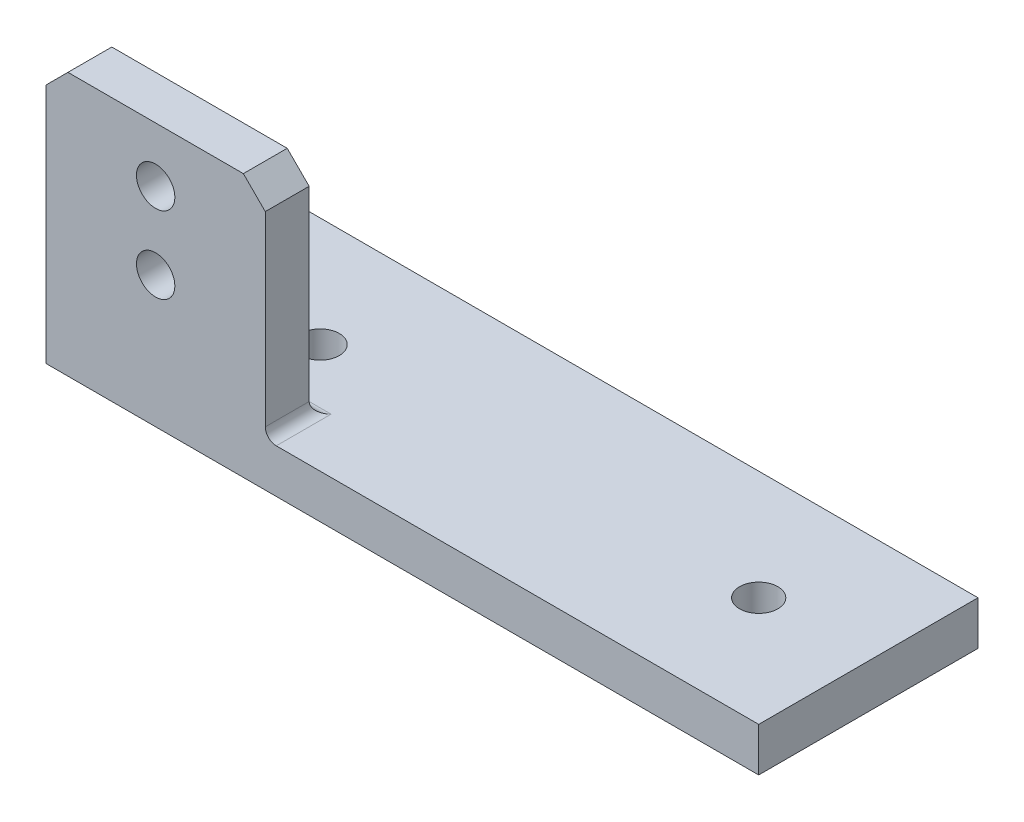
ISO-10303-21;
HEADER;
FILE_DESCRIPTION(('STEP AP214'),'2;1');
FILE_NAME('part.step','',(''),(''),'','','');
FILE_SCHEMA(('AUTOMOTIVE_DESIGN { 1 0 10303 214 1 1 1 1 }'));
ENDSEC;
DATA;
#1=APPLICATION_CONTEXT('core data for automotive mechanical design processes');
#2=APPLICATION_PROTOCOL_DEFINITION('international standard','automotive_design',2000,#1);
#3=PRODUCT_CONTEXT('',#1,'mechanical');
#4=PRODUCT('Part','Part','',(#3));
#5=PRODUCT_RELATED_PRODUCT_CATEGORY('part','',(#4));
#6=PRODUCT_DEFINITION_FORMATION('','',#4);
#7=PRODUCT_DEFINITION_CONTEXT('part definition',#1,'design');
#8=PRODUCT_DEFINITION('design','',#6,#7);
#9=PRODUCT_DEFINITION_SHAPE('','',#8);
#10=(LENGTH_UNIT() NAMED_UNIT(*) SI_UNIT(.MILLI.,.METRE.));
#11=(NAMED_UNIT(*) PLANE_ANGLE_UNIT() SI_UNIT($,.RADIAN.));
#12=(NAMED_UNIT(*) SI_UNIT($,.STERADIAN.) SOLID_ANGLE_UNIT());
#13=UNCERTAINTY_MEASURE_WITH_UNIT(LENGTH_MEASURE(1.E-05),#10,'distance_accuracy_value','');
#14=(GEOMETRIC_REPRESENTATION_CONTEXT(3) GLOBAL_UNCERTAINTY_ASSIGNED_CONTEXT((#13)) GLOBAL_UNIT_ASSIGNED_CONTEXT((#10,
#11,#12)) REPRESENTATION_CONTEXT('',''));
#15=CARTESIAN_POINT('',(0.,0.,0.));
#16=DIRECTION('',(0.,0.,1.));
#17=DIRECTION('',(1.,0.,0.));
#18=AXIS2_PLACEMENT_3D('',#15,#16,#17);
#19=CARTESIAN_POINT('',(65.,4.,20.));
#20=DIRECTION('',(0.,-1.,0.));
#21=DIRECTION('',(0.,0.,-1.));
#22=AXIS2_PLACEMENT_3D('',#19,#20,#21);
#23=PLANE('',#22);
#24=CARTESIAN_POINT('',(55.,4.,10.));
#25=DIRECTION('',(0.,1.,0.));
#26=DIRECTION('',(0.,0.,1.));
#27=AXIS2_PLACEMENT_3D('',#24,#25,#26);
#28=CIRCLE('',#27,1.75);
#29=CARTESIAN_POINT('',(55.,4.,11.75));
#30=VERTEX_POINT('',#29);
#31=EDGE_CURVE('E422',#30,#30,#28,.T.);
#32=ORIENTED_EDGE('',*,*,#31,.F.);
#33=EDGE_LOOP('',(#32));
#34=FACE_BOUND('',#33,.T.);
#35=CARTESIAN_POINT('',(15.,4.,10.));
#36=DIRECTION('',(0.,1.,0.));
#37=DIRECTION('',(0.,0.,1.));
#38=AXIS2_PLACEMENT_3D('',#35,#36,#37);
#39=CIRCLE('',#38,1.75);
#40=CARTESIAN_POINT('',(15.,4.,11.75));
#41=VERTEX_POINT('',#40);
#42=EDGE_CURVE('E433',#41,#41,#39,.T.);
#43=ORIENTED_EDGE('',*,*,#42,.F.);
#44=EDGE_LOOP('',(#43));
#45=FACE_BOUND('',#44,.T.);
#46=DIRECTION('',(-1.,0.,0.));
#47=VECTOR('',#46,1.);
#48=CARTESIAN_POINT('',(65.,4.,0.));
#49=LINE('',#48,#47);
#50=CARTESIAN_POINT('',(65.,4.,0.));
#51=VERTEX_POINT('',#50);
#52=CARTESIAN_POINT('',(2.00000000000001,4.,0.));
#53=VERTEX_POINT('',#52);
#54=EDGE_CURVE('E127',#51,#53,#49,.T.);
#55=ORIENTED_EDGE('',*,*,#54,.T.);
#56=DIRECTION('',(0.707106781186549,0.,-0.707106781186546));
#57=VECTOR('',#56,1.);
#58=CARTESIAN_POINT('',(0.,4.,1.99999999999999));
#59=LINE('',#58,#57);
#60=CARTESIAN_POINT('',(0.,4.,1.99999999999999));
#61=VERTEX_POINT('',#60);
#62=EDGE_CURVE('E11',#53,#61,#59,.F.);
#63=ORIENTED_EDGE('',*,*,#62,.T.);
#64=DIRECTION('',(0.,0.,-1.));
#65=VECTOR('',#64,1.);
#66=CARTESIAN_POINT('',(0.,4.,20.));
#67=LINE('',#66,#65);
#68=CARTESIAN_POINT('',(0.,4.,15.));
#69=VERTEX_POINT('',#68);
#70=EDGE_CURVE('E154',#69,#61,#67,.T.);
#71=ORIENTED_EDGE('',*,*,#70,.F.);
#72=DIRECTION('',(-1.,0.,0.));
#73=VECTOR('',#72,1.);
#74=CARTESIAN_POINT('',(20.,4.,15.));
#75=LINE('',#74,#73);
#76=CARTESIAN_POINT('',(21.,4.,15.));
#77=VERTEX_POINT('',#76);
#78=EDGE_CURVE('E144',#69,#77,#75,.F.);
#79=ORIENTED_EDGE('',*,*,#78,.T.);
#80=DIRECTION('',(0.,0.,-1.));
#81=VECTOR('',#80,1.);
#82=CARTESIAN_POINT('',(21.,4.,20.));
#83=LINE('',#82,#81);
#84=CARTESIAN_POINT('',(21.,4.,20.));
#85=VERTEX_POINT('',#84);
#86=EDGE_CURVE('E175',#77,#85,#83,.F.);
#87=ORIENTED_EDGE('',*,*,#86,.T.);
#88=DIRECTION('',(-1.,0.,0.));
#89=VECTOR('',#88,1.);
#90=CARTESIAN_POINT('',(65.,4.,20.));
#91=LINE('',#90,#89);
#92=CARTESIAN_POINT('',(65.,4.,20.));
#93=VERTEX_POINT('',#92);
#94=EDGE_CURVE('E150',#93,#85,#91,.T.);
#95=ORIENTED_EDGE('',*,*,#94,.F.);
#96=DIRECTION('',(0.,0.,-1.));
#97=VECTOR('',#96,1.);
#98=CARTESIAN_POINT('',(65.,4.,20.));
#99=LINE('',#98,#97);
#100=EDGE_CURVE('E146',#93,#51,#99,.T.);
#101=ORIENTED_EDGE('',*,*,#100,.T.);
#102=EDGE_LOOP('',(#55,#63,#71,#79,#87,#95,#101));
#103=FACE_BOUND('',#102,.T.);
#104=ADVANCED_FACE('F33',(#34,#45,#103),#23,.F.);
#105=CARTESIAN_POINT('',(0.,4.,20.));
#106=DIRECTION('',(1.,0.,0.));
#107=DIRECTION('',(0.,1.,0.));
#108=AXIS2_PLACEMENT_3D('',#105,#106,#107);
#109=PLANE('',#108);
#110=ORIENTED_EDGE('',*,*,#70,.T.);
#111=DIRECTION('',(0.,-1.,0.));
#112=VECTOR('',#111,1.);
#113=CARTESIAN_POINT('',(0.,4.,1.99999999999999));
#114=LINE('',#113,#112);
#115=CARTESIAN_POINT('',(0.,0.,1.99999999999999));
#116=VERTEX_POINT('',#115);
#117=EDGE_CURVE('E140',#61,#116,#114,.T.);
#118=ORIENTED_EDGE('',*,*,#117,.T.);
#119=DIRECTION('',(0.,0.,-1.));
#120=VECTOR('',#119,1.);
#121=CARTESIAN_POINT('',(0.,0.,20.));
#122=LINE('',#121,#120);
#123=CARTESIAN_POINT('',(0.,0.,20.));
#124=VERTEX_POINT('',#123);
#125=EDGE_CURVE('E130',#124,#116,#122,.T.);
#126=ORIENTED_EDGE('',*,*,#125,.F.);
#127=DIRECTION('',(0.,-1.,0.));
#128=VECTOR('',#127,1.);
#129=CARTESIAN_POINT('',(0.,4.,20.));
#130=LINE('',#129,#128);
#131=CARTESIAN_POINT('',(0.,22.,20.));
#132=VERTEX_POINT('',#131);
#133=EDGE_CURVE('E117',#132,#124,#130,.T.);
#134=ORIENTED_EDGE('',*,*,#133,.F.);
#135=DIRECTION('',(0.,0.,-1.));
#136=VECTOR('',#135,1.);
#137=CARTESIAN_POINT('',(0.,22.,20.));
#138=LINE('',#137,#136);
#139=CARTESIAN_POINT('',(0.,22.,16.));
#140=VERTEX_POINT('',#139);
#141=EDGE_CURVE('E194',#132,#140,#138,.T.);
#142=ORIENTED_EDGE('',*,*,#141,.T.);
#143=DIRECTION('',(0.,-1.,0.));
#144=VECTOR('',#143,1.);
#145=CARTESIAN_POINT('',(0.,24.,16.));
#146=LINE('',#145,#144);
#147=CARTESIAN_POINT('',(0.,5.,16.));
#148=VERTEX_POINT('',#147);
#149=EDGE_CURVE('E195',#140,#148,#146,.T.);
#150=ORIENTED_EDGE('',*,*,#149,.T.);
#151=CARTESIAN_POINT('',(0.,5.,15.));
#152=DIRECTION('',(1.,0.,0.));
#153=DIRECTION('',(0.,1.,0.));
#154=AXIS2_PLACEMENT_3D('',#151,#152,#153);
#155=CIRCLE('',#154,1.);
#156=EDGE_CURVE('E170',#148,#69,#155,.T.);
#157=ORIENTED_EDGE('',*,*,#156,.T.);
#158=EDGE_LOOP('',(#110,#118,#126,#134,#142,#150,#157));
#159=FACE_BOUND('',#158,.T.);
#160=ADVANCED_FACE('F138',(#159),#109,.F.);
#161=CARTESIAN_POINT('',(0.,0.,20.));
#162=DIRECTION('',(0.,1.,0.));
#163=DIRECTION('',(0.,0.,1.));
#164=AXIS2_PLACEMENT_3D('',#161,#162,#163);
#165=PLANE('',#164);
#166=CARTESIAN_POINT('',(55.,0.,10.));
#167=DIRECTION('',(0.,1.,0.));
#168=DIRECTION('',(0.,0.,1.));
#169=AXIS2_PLACEMENT_3D('',#166,#167,#168);
#170=CIRCLE('',#169,1.75);
#171=CARTESIAN_POINT('',(55.,0.,11.75));
#172=VERTEX_POINT('',#171);
#173=EDGE_CURVE('E430',#172,#172,#170,.F.);
#174=ORIENTED_EDGE('',*,*,#173,.F.);
#175=EDGE_LOOP('',(#174));
#176=FACE_BOUND('',#175,.T.);
#177=CARTESIAN_POINT('',(15.,0.,10.));
#178=DIRECTION('',(0.,1.,0.));
#179=DIRECTION('',(0.,0.,1.));
#180=AXIS2_PLACEMENT_3D('',#177,#178,#179);
#181=CIRCLE('',#180,1.75);
#182=CARTESIAN_POINT('',(15.,0.,11.75));
#183=VERTEX_POINT('',#182);
#184=EDGE_CURVE('E230',#183,#183,#181,.F.);
#185=ORIENTED_EDGE('',*,*,#184,.F.);
#186=EDGE_LOOP('',(#185));
#187=FACE_BOUND('',#186,.T.);
#188=ORIENTED_EDGE('',*,*,#125,.T.);
#189=DIRECTION('',(-0.707106781186549,0.,0.707106781186546));
#190=VECTOR('',#189,1.);
#191=CARTESIAN_POINT('',(0.,0.,1.99999999999999));
#192=LINE('',#191,#190);
#193=CARTESIAN_POINT('',(1.99999999999999,0.,0.));
#194=VERTEX_POINT('',#193);
#195=EDGE_CURVE('E55',#116,#194,#192,.F.);
#196=ORIENTED_EDGE('',*,*,#195,.T.);
#197=DIRECTION('',(1.,0.,0.));
#198=VECTOR('',#197,1.);
#199=CARTESIAN_POINT('',(0.,0.,0.));
#200=LINE('',#199,#198);
#201=CARTESIAN_POINT('',(65.,0.,0.));
#202=VERTEX_POINT('',#201);
#203=EDGE_CURVE('E160',#194,#202,#200,.T.);
#204=ORIENTED_EDGE('',*,*,#203,.T.);
#205=DIRECTION('',(0.,0.,-1.));
#206=VECTOR('',#205,1.);
#207=CARTESIAN_POINT('',(65.,0.,20.));
#208=LINE('',#207,#206);
#209=CARTESIAN_POINT('',(65.,0.,20.));
#210=VERTEX_POINT('',#209);
#211=EDGE_CURVE('E132',#210,#202,#208,.T.);
#212=ORIENTED_EDGE('',*,*,#211,.F.);
#213=DIRECTION('',(1.,0.,0.));
#214=VECTOR('',#213,1.);
#215=CARTESIAN_POINT('',(0.,0.,20.));
#216=LINE('',#215,#214);
#217=EDGE_CURVE('E121',#124,#210,#216,.T.);
#218=ORIENTED_EDGE('',*,*,#217,.F.);
#219=EDGE_LOOP('',(#188,#196,#204,#212,#218));
#220=FACE_BOUND('',#219,.T.);
#221=ADVANCED_FACE('F129',(#176,#187,#220),#165,.F.);
#222=CARTESIAN_POINT('',(65.,0.,20.));
#223=DIRECTION('',(-1.,0.,0.));
#224=DIRECTION('',(0.,0.,1.));
#225=AXIS2_PLACEMENT_3D('',#222,#223,#224);
#226=PLANE('',#225);
#227=DIRECTION('',(0.,1.,0.));
#228=VECTOR('',#227,1.);
#229=CARTESIAN_POINT('',(65.,0.,0.));
#230=LINE('',#229,#228);
#231=EDGE_CURVE('E162',#202,#51,#230,.T.);
#232=ORIENTED_EDGE('',*,*,#231,.T.);
#233=ORIENTED_EDGE('',*,*,#100,.F.);
#234=DIRECTION('',(0.,1.,0.));
#235=VECTOR('',#234,1.);
#236=CARTESIAN_POINT('',(65.,0.,20.));
#237=LINE('',#236,#235);
#238=EDGE_CURVE('E134',#210,#93,#237,.T.);
#239=ORIENTED_EDGE('',*,*,#238,.F.);
#240=ORIENTED_EDGE('',*,*,#211,.T.);
#241=EDGE_LOOP('',(#232,#233,#239,#240));
#242=FACE_BOUND('',#241,.T.);
#243=ADVANCED_FACE('F266',(#242),#226,.F.);
#244=CARTESIAN_POINT('',(0.,0.,20.));
#245=DIRECTION('',(0.,0.,1.));
#246=DIRECTION('',(1.,0.,0.));
#247=AXIS2_PLACEMENT_3D('',#244,#245,#246);
#248=PLANE('',#247);
#249=CARTESIAN_POINT('',(10.,12.,20.));
#250=DIRECTION('',(0.,0.,1.));
#251=DIRECTION('',(1.,0.,0.));
#252=AXIS2_PLACEMENT_3D('',#249,#250,#251);
#253=CIRCLE('',#252,1.75);
#254=CARTESIAN_POINT('',(11.75,12.,20.));
#255=VERTEX_POINT('',#254);
#256=EDGE_CURVE('E414',#255,#255,#253,.F.);
#257=ORIENTED_EDGE('',*,*,#256,.T.);
#258=EDGE_LOOP('',(#257));
#259=FACE_BOUND('',#258,.T.);
#260=CARTESIAN_POINT('',(10.,19.,20.));
#261=DIRECTION('',(0.,0.,1.));
#262=DIRECTION('',(1.,0.,0.));
#263=AXIS2_PLACEMENT_3D('',#260,#261,#262);
#264=CIRCLE('',#263,1.75);
#265=CARTESIAN_POINT('',(11.75,19.,20.));
#266=VERTEX_POINT('',#265);
#267=EDGE_CURVE('E417',#266,#266,#264,.F.);
#268=ORIENTED_EDGE('',*,*,#267,.T.);
#269=EDGE_LOOP('',(#268));
#270=FACE_BOUND('',#269,.T.);
#271=DIRECTION('',(1.,0.,0.));
#272=VECTOR('',#271,1.);
#273=CARTESIAN_POINT('',(0.,24.,20.));
#274=LINE('',#273,#272);
#275=CARTESIAN_POINT('',(1.99999999999999,24.,20.));
#276=VERTEX_POINT('',#275);
#277=CARTESIAN_POINT('',(18.,24.,20.));
#278=VERTEX_POINT('',#277);
#279=EDGE_CURVE('E224',#276,#278,#274,.T.);
#280=ORIENTED_EDGE('',*,*,#279,.F.);
#281=DIRECTION('',(0.707106781186545,0.70710678118655,0.));
#282=VECTOR('',#281,1.);
#283=CARTESIAN_POINT('',(-11.,10.9999999999999,20.));
#284=LINE('',#283,#282);
#285=EDGE_CURVE('E123',#276,#132,#284,.F.);
#286=ORIENTED_EDGE('',*,*,#285,.T.);
#287=ORIENTED_EDGE('',*,*,#133,.T.);
#288=ORIENTED_EDGE('',*,*,#217,.T.);
#289=ORIENTED_EDGE('',*,*,#238,.T.);
#290=ORIENTED_EDGE('',*,*,#94,.T.);
#291=CARTESIAN_POINT('',(21.,5.,20.));
#292=DIRECTION('',(0.,0.,1.));
#293=DIRECTION('',(1.,0.,0.));
#294=AXIS2_PLACEMENT_3D('',#291,#292,#293);
#295=CIRCLE('',#294,1.);
#296=CARTESIAN_POINT('',(20.,5.,20.));
#297=VERTEX_POINT('',#296);
#298=EDGE_CURVE('E180',#85,#297,#295,.F.);
#299=ORIENTED_EDGE('',*,*,#298,.T.);
#300=DIRECTION('',(0.,-1.,0.));
#301=VECTOR('',#300,1.);
#302=CARTESIAN_POINT('',(20.,24.,20.));
#303=LINE('',#302,#301);
#304=CARTESIAN_POINT('',(20.,22.,20.));
#305=VERTEX_POINT('',#304);
#306=EDGE_CURVE('E163',#305,#297,#303,.T.);
#307=ORIENTED_EDGE('',*,*,#306,.F.);
#308=DIRECTION('',(0.707106781186546,-0.707106781186549,0.));
#309=VECTOR('',#308,1.);
#310=CARTESIAN_POINT('',(21.,21.,20.));
#311=LINE('',#310,#309);
#312=EDGE_CURVE('E189',#305,#278,#311,.F.);
#313=ORIENTED_EDGE('',*,*,#312,.T.);
#314=EDGE_LOOP('',(#280,#286,#287,#288,#289,#290,#299,#307,#313));
#315=FACE_BOUND('',#314,.T.);
#316=ADVANCED_FACE('F120',(#259,#270,#315),#248,.T.);
#317=CARTESIAN_POINT('',(0.,0.,0.));
#318=DIRECTION('',(0.,0.,1.));
#319=DIRECTION('',(1.,0.,0.));
#320=AXIS2_PLACEMENT_3D('',#317,#318,#319);
#321=PLANE('',#320);
#322=ORIENTED_EDGE('',*,*,#203,.F.);
#323=DIRECTION('',(0.,1.,0.));
#324=VECTOR('',#323,1.);
#325=CARTESIAN_POINT('',(1.99999999999999,0.,0.));
#326=LINE('',#325,#324);
#327=EDGE_CURVE('E41',#194,#53,#326,.T.);
#328=ORIENTED_EDGE('',*,*,#327,.T.);
#329=ORIENTED_EDGE('',*,*,#54,.F.);
#330=ORIENTED_EDGE('',*,*,#231,.F.);
#331=EDGE_LOOP('',(#322,#328,#329,#330));
#332=FACE_BOUND('',#331,.T.);
#333=ADVANCED_FACE('F264',(#332),#321,.F.);
#334=CARTESIAN_POINT('',(20.,24.,20.));
#335=DIRECTION('',(-1.,0.,0.));
#336=DIRECTION('',(0.,0.,1.));
#337=AXIS2_PLACEMENT_3D('',#334,#335,#336);
#338=PLANE('',#337);
#339=DIRECTION('',(0.,-1.,0.));
#340=VECTOR('',#339,1.);
#341=CARTESIAN_POINT('',(20.,24.,16.));
#342=LINE('',#341,#340);
#343=CARTESIAN_POINT('',(20.,22.,16.));
#344=VERTEX_POINT('',#343);
#345=CARTESIAN_POINT('',(20.,5.,16.));
#346=VERTEX_POINT('',#345);
#347=EDGE_CURVE('E191',#344,#346,#342,.T.);
#348=ORIENTED_EDGE('',*,*,#347,.F.);
#349=DIRECTION('',(0.,0.,1.));
#350=VECTOR('',#349,1.);
#351=CARTESIAN_POINT('',(20.,22.,20.));
#352=LINE('',#351,#350);
#353=EDGE_CURVE('E204',#344,#305,#352,.T.);
#354=ORIENTED_EDGE('',*,*,#353,.T.);
#355=ORIENTED_EDGE('',*,*,#306,.T.);
#356=DIRECTION('',(0.,0.,-1.));
#357=VECTOR('',#356,1.);
#358=CARTESIAN_POINT('',(20.,5.,15.));
#359=LINE('',#358,#357);
#360=EDGE_CURVE('E172',#297,#346,#359,.T.);
#361=ORIENTED_EDGE('',*,*,#360,.T.);
#362=EDGE_LOOP('',(#348,#354,#355,#361));
#363=FACE_BOUND('',#362,.T.);
#364=ADVANCED_FACE('F211',(#363),#338,.F.);
#365=CARTESIAN_POINT('',(0.,24.,16.));
#366=DIRECTION('',(0.,0.,1.));
#367=DIRECTION('',(1.,0.,0.));
#368=AXIS2_PLACEMENT_3D('',#365,#366,#367);
#369=PLANE('',#368);
#370=CARTESIAN_POINT('',(10.,12.,16.));
#371=DIRECTION('',(0.,0.,-1.));
#372=DIRECTION('',(-1.,0.,0.));
#373=AXIS2_PLACEMENT_3D('',#370,#371,#372);
#374=CIRCLE('',#373,1.75);
#375=CARTESIAN_POINT('',(8.25,12.,16.));
#376=VERTEX_POINT('',#375);
#377=EDGE_CURVE('E419',#376,#376,#374,.T.);
#378=ORIENTED_EDGE('',*,*,#377,.F.);
#379=EDGE_LOOP('',(#378));
#380=FACE_BOUND('',#379,.T.);
#381=CARTESIAN_POINT('',(10.,19.,16.));
#382=DIRECTION('',(0.,0.,-1.));
#383=DIRECTION('',(-1.,0.,0.));
#384=AXIS2_PLACEMENT_3D('',#381,#382,#383);
#385=CIRCLE('',#384,1.75);
#386=CARTESIAN_POINT('',(8.25,19.,16.));
#387=VERTEX_POINT('',#386);
#388=EDGE_CURVE('E418',#387,#387,#385,.T.);
#389=ORIENTED_EDGE('',*,*,#388,.F.);
#390=EDGE_LOOP('',(#389));
#391=FACE_BOUND('',#390,.T.);
#392=ORIENTED_EDGE('',*,*,#149,.F.);
#393=DIRECTION('',(-0.707106781186545,-0.70710678118655,0.));
#394=VECTOR('',#393,1.);
#395=CARTESIAN_POINT('',(1.99999999999999,24.,16.));
#396=LINE('',#395,#394);
#397=CARTESIAN_POINT('',(1.99999999999998,24.,16.));
#398=VERTEX_POINT('',#397);
#399=EDGE_CURVE('E202',#140,#398,#396,.F.);
#400=ORIENTED_EDGE('',*,*,#399,.T.);
#401=DIRECTION('',(-1.,0.,0.));
#402=VECTOR('',#401,1.);
#403=CARTESIAN_POINT('',(0.,24.,16.));
#404=LINE('',#403,#402);
#405=CARTESIAN_POINT('',(18.,24.,16.));
#406=VERTEX_POINT('',#405);
#407=EDGE_CURVE('E197',#406,#398,#404,.T.);
#408=ORIENTED_EDGE('',*,*,#407,.F.);
#409=DIRECTION('',(-0.707106781186546,0.707106781186549,0.));
#410=VECTOR('',#409,1.);
#411=CARTESIAN_POINT('',(18.,24.,16.));
#412=LINE('',#411,#410);
#413=EDGE_CURVE('E200',#406,#344,#412,.F.);
#414=ORIENTED_EDGE('',*,*,#413,.T.);
#415=ORIENTED_EDGE('',*,*,#347,.T.);
#416=DIRECTION('',(-1.,0.,0.));
#417=VECTOR('',#416,1.);
#418=CARTESIAN_POINT('',(0.,5.,16.));
#419=LINE('',#418,#417);
#420=EDGE_CURVE('E141',#346,#148,#419,.T.);
#421=ORIENTED_EDGE('',*,*,#420,.T.);
#422=EDGE_LOOP('',(#392,#400,#408,#414,#415,#421));
#423=FACE_BOUND('',#422,.T.);
#424=ADVANCED_FACE('F227',(#380,#391,#423),#369,.F.);
#425=CARTESIAN_POINT('',(0.,24.,0.));
#426=DIRECTION('',(0.,-1.,0.));
#427=DIRECTION('',(0.,0.,-1.));
#428=AXIS2_PLACEMENT_3D('',#425,#426,#427);
#429=PLANE('',#428);
#430=ORIENTED_EDGE('',*,*,#407,.T.);
#431=DIRECTION('',(0.,0.,1.));
#432=VECTOR('',#431,1.);
#433=CARTESIAN_POINT('',(1.99999999999999,24.,0.));
#434=LINE('',#433,#432);
#435=EDGE_CURVE('E186',#398,#276,#434,.T.);
#436=ORIENTED_EDGE('',*,*,#435,.T.);
#437=ORIENTED_EDGE('',*,*,#279,.T.);
#438=DIRECTION('',(0.,0.,-1.));
#439=VECTOR('',#438,1.);
#440=CARTESIAN_POINT('',(18.,24.,0.));
#441=LINE('',#440,#439);
#442=EDGE_CURVE('E183',#278,#406,#441,.T.);
#443=ORIENTED_EDGE('',*,*,#442,.T.);
#444=EDGE_LOOP('',(#430,#436,#437,#443));
#445=FACE_BOUND('',#444,.T.);
#446=ADVANCED_FACE('F222',(#445),#429,.F.);
#447=CARTESIAN_POINT('',(15.,-0.00100000000000013,10.));
#448=DIRECTION('',(0.,1.,0.));
#449=DIRECTION('',(0.,0.,1.));
#450=AXIS2_PLACEMENT_3D('',#447,#448,#449);
#451=CYLINDRICAL_SURFACE('',#450,1.75);
#452=ORIENTED_EDGE('',*,*,#42,.T.);
#453=EDGE_LOOP('',(#452));
#454=FACE_BOUND('',#453,.T.);
#455=ORIENTED_EDGE('',*,*,#184,.T.);
#456=EDGE_LOOP('',(#455));
#457=FACE_BOUND('',#456,.T.);
#458=ADVANCED_FACE('F343',(#454,#457),#451,.F.);
#459=CARTESIAN_POINT('',(55.,-0.00100000000000013,10.));
#460=DIRECTION('',(0.,1.,0.));
#461=DIRECTION('',(0.,0.,1.));
#462=AXIS2_PLACEMENT_3D('',#459,#460,#461);
#463=CYLINDRICAL_SURFACE('',#462,1.75);
#464=ORIENTED_EDGE('',*,*,#31,.T.);
#465=EDGE_LOOP('',(#464));
#466=FACE_BOUND('',#465,.T.);
#467=ORIENTED_EDGE('',*,*,#173,.T.);
#468=EDGE_LOOP('',(#467));
#469=FACE_BOUND('',#468,.T.);
#470=ADVANCED_FACE('F350',(#466,#469),#463,.F.);
#471=CARTESIAN_POINT('',(10.,19.,20.00105));
#472=DIRECTION('',(0.,0.,-1.));
#473=DIRECTION('',(-1.,0.,0.));
#474=AXIS2_PLACEMENT_3D('',#471,#472,#473);
#475=CYLINDRICAL_SURFACE('',#474,1.75);
#476=ORIENTED_EDGE('',*,*,#267,.F.);
#477=EDGE_LOOP('',(#476));
#478=FACE_BOUND('',#477,.T.);
#479=ORIENTED_EDGE('',*,*,#388,.T.);
#480=EDGE_LOOP('',(#479));
#481=FACE_BOUND('',#480,.T.);
#482=ADVANCED_FACE('F359',(#478,#481),#475,.F.);
#483=CARTESIAN_POINT('',(10.,12.,20.00105));
#484=DIRECTION('',(0.,0.,-1.));
#485=DIRECTION('',(-1.,0.,0.));
#486=AXIS2_PLACEMENT_3D('',#483,#484,#485);
#487=CYLINDRICAL_SURFACE('',#486,1.75);
#488=ORIENTED_EDGE('',*,*,#256,.F.);
#489=EDGE_LOOP('',(#488));
#490=FACE_BOUND('',#489,.T.);
#491=ORIENTED_EDGE('',*,*,#377,.T.);
#492=EDGE_LOOP('',(#491));
#493=FACE_BOUND('',#492,.T.);
#494=ADVANCED_FACE('F275',(#490,#493),#487,.F.);
#495=CARTESIAN_POINT('',(0.,5.,15.));
#496=DIRECTION('',(1.,0.,0.));
#497=DIRECTION('',(0.,0.,-1.));
#498=AXIS2_PLACEMENT_3D('',#495,#496,#497);
#499=CYLINDRICAL_SURFACE('',#498,1.);
#500=ORIENTED_EDGE('',*,*,#420,.F.);
#501=CARTESIAN_POINT('',(21.,5.,15.));
#502=DIRECTION('',(0.707106781186547,0.,0.707106781186547));
#503=DIRECTION('',(0.707106781186547,0.,-0.707106781186547));
#504=AXIS2_PLACEMENT_3D('',#501,#502,#503);
#505=ELLIPSE('',#504,1.41421356237309,1.);
#506=EDGE_CURVE('E177',#346,#77,#505,.T.);
#507=ORIENTED_EDGE('',*,*,#506,.T.);
#508=ORIENTED_EDGE('',*,*,#78,.F.);
#509=ORIENTED_EDGE('',*,*,#156,.F.);
#510=EDGE_LOOP('',(#500,#507,#508,#509));
#511=FACE_BOUND('',#510,.T.);
#512=ADVANCED_FACE('F242',(#511),#499,.F.);
#513=CARTESIAN_POINT('',(21.,5.,20.));
#514=DIRECTION('',(0.,0.,1.));
#515=DIRECTION('',(1.,0.,0.));
#516=AXIS2_PLACEMENT_3D('',#513,#514,#515);
#517=CYLINDRICAL_SURFACE('',#516,1.);
#518=ORIENTED_EDGE('',*,*,#298,.F.);
#519=ORIENTED_EDGE('',*,*,#86,.F.);
#520=ORIENTED_EDGE('',*,*,#506,.F.);
#521=ORIENTED_EDGE('',*,*,#360,.F.);
#522=EDGE_LOOP('',(#518,#519,#520,#521));
#523=FACE_BOUND('',#522,.T.);
#524=ADVANCED_FACE('F238',(#523),#517,.F.);
#525=CARTESIAN_POINT('',(1.99999999999999,24.,0.));
#526=DIRECTION('',(0.70710678118655,-0.707106781186545,0.));
#527=DIRECTION('',(0.,0.,1.));
#528=AXIS2_PLACEMENT_3D('',#525,#526,#527);
#529=PLANE('',#528);
#530=ORIENTED_EDGE('',*,*,#399,.F.);
#531=ORIENTED_EDGE('',*,*,#141,.F.);
#532=ORIENTED_EDGE('',*,*,#285,.F.);
#533=ORIENTED_EDGE('',*,*,#435,.F.);
#534=EDGE_LOOP('',(#530,#531,#532,#533));
#535=FACE_BOUND('',#534,.T.);
#536=ADVANCED_FACE('F252',(#535),#529,.F.);
#537=CARTESIAN_POINT('',(18.,24.,0.));
#538=DIRECTION('',(-0.707106781186549,-0.707106781186546,0.));
#539=DIRECTION('',(0.,0.,-1.));
#540=AXIS2_PLACEMENT_3D('',#537,#538,#539);
#541=PLANE('',#540);
#542=ORIENTED_EDGE('',*,*,#312,.F.);
#543=ORIENTED_EDGE('',*,*,#353,.F.);
#544=ORIENTED_EDGE('',*,*,#413,.F.);
#545=ORIENTED_EDGE('',*,*,#442,.F.);
#546=EDGE_LOOP('',(#542,#543,#544,#545));
#547=FACE_BOUND('',#546,.T.);
#548=ADVANCED_FACE('F218',(#547),#541,.F.);
#549=CARTESIAN_POINT('',(0.,4.,1.99999999999999));
#550=DIRECTION('',(0.707106781186546,0.,0.707106781186549));
#551=DIRECTION('',(0.,-1.,0.));
#552=AXIS2_PLACEMENT_3D('',#549,#550,#551);
#553=PLANE('',#552);
#554=ORIENTED_EDGE('',*,*,#62,.F.);
#555=ORIENTED_EDGE('',*,*,#327,.F.);
#556=ORIENTED_EDGE('',*,*,#195,.F.);
#557=ORIENTED_EDGE('',*,*,#117,.F.);
#558=EDGE_LOOP('',(#554,#555,#556,#557));
#559=FACE_BOUND('',#558,.T.);
#560=ADVANCED_FACE('F35',(#559),#553,.F.);
#561=CLOSED_SHELL('',(#104,#160,#221,#243,#316,#333,#364,#424,#446,#458,#470,#482,#494,#512,
#524,#536,#548,#560));
#562=MANIFOLD_SOLID_BREP('B2',#561);
#563=ADVANCED_BREP_SHAPE_REPRESENTATION('',(#18,#562),#14);
#564=SHAPE_DEFINITION_REPRESENTATION(#9,#563);
ENDSEC;
END-ISO-10303-21;
